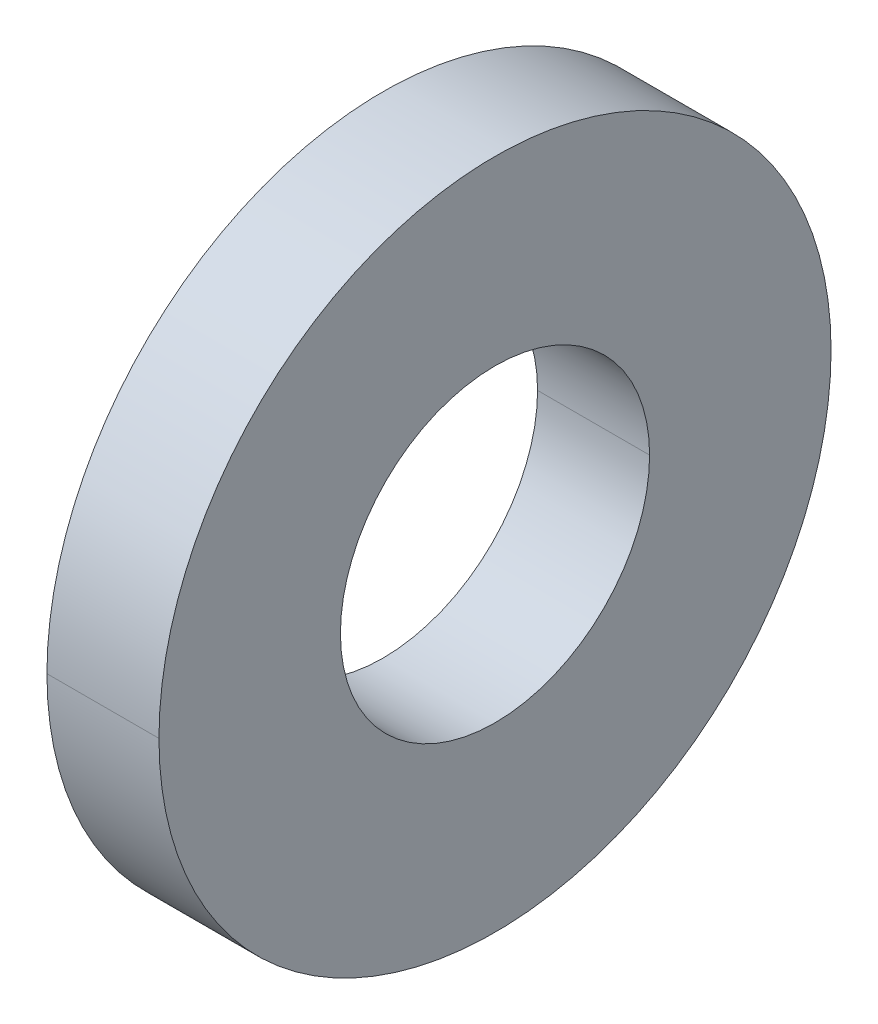
ISO-10303-21;
HEADER;
FILE_DESCRIPTION(('STEP AP214'),'2;1');
FILE_NAME('part.step','',(''),(''),'','','');
FILE_SCHEMA(('AUTOMOTIVE_DESIGN { 1 0 10303 214 1 1 1 1 }'));
ENDSEC;
DATA;
#1=APPLICATION_CONTEXT('core data for automotive mechanical design processes');
#2=APPLICATION_PROTOCOL_DEFINITION('international standard','automotive_design',2000,#1);
#3=PRODUCT_CONTEXT('',#1,'mechanical');
#4=PRODUCT('Part','Part','',(#3));
#5=PRODUCT_RELATED_PRODUCT_CATEGORY('part','',(#4));
#6=PRODUCT_DEFINITION_FORMATION('','',#4);
#7=PRODUCT_DEFINITION_CONTEXT('part definition',#1,'design');
#8=PRODUCT_DEFINITION('design','',#6,#7);
#9=PRODUCT_DEFINITION_SHAPE('','',#8);
#10=(LENGTH_UNIT() NAMED_UNIT(*) SI_UNIT(.MILLI.,.METRE.));
#11=(NAMED_UNIT(*) PLANE_ANGLE_UNIT() SI_UNIT($,.RADIAN.));
#12=(NAMED_UNIT(*) SI_UNIT($,.STERADIAN.) SOLID_ANGLE_UNIT());
#13=UNCERTAINTY_MEASURE_WITH_UNIT(LENGTH_MEASURE(1.E-05),#10,'distance_accuracy_value','');
#14=(GEOMETRIC_REPRESENTATION_CONTEXT(3) GLOBAL_UNCERTAINTY_ASSIGNED_CONTEXT((#13)) GLOBAL_UNIT_ASSIGNED_CONTEXT((#10,
#11,#12)) REPRESENTATION_CONTEXT('',''));
#15=CARTESIAN_POINT('',(0.,0.,0.));
#16=DIRECTION('',(0.,0.,1.));
#17=DIRECTION('',(1.,0.,0.));
#18=AXIS2_PLACEMENT_3D('',#15,#16,#17);
#19=CARTESIAN_POINT('',(-1.5875,9.525,0.));
#20=DIRECTION('',(-1.,0.,0.));
#21=DIRECTION('',(0.,0.,1.));
#22=AXIS2_PLACEMENT_3D('',#19,#20,#21);
#23=PLANE('',#22);
#24=CARTESIAN_POINT('',(-1.5875,0.,0.));
#25=DIRECTION('',(1.,0.,0.));
#26=DIRECTION('',(0.,0.,-1.));
#27=AXIS2_PLACEMENT_3D('',#24,#25,#26);
#28=CIRCLE('',#27,4.3815);
#29=CARTESIAN_POINT('',(-1.5875,0.,-4.3815));
#30=VERTEX_POINT('',#29);
#31=CARTESIAN_POINT('',(-1.5875,0.,4.3815));
#32=VERTEX_POINT('',#31);
#33=EDGE_CURVE('E11',#30,#32,#28,.T.);
#34=ORIENTED_EDGE('',*,*,#33,.T.);
#35=CARTESIAN_POINT('',(-1.5875,0.,0.));
#36=DIRECTION('',(1.,0.,0.));
#37=DIRECTION('',(0.,0.,-1.));
#38=AXIS2_PLACEMENT_3D('',#35,#36,#37);
#39=CIRCLE('',#38,4.3815);
#40=EDGE_CURVE('E25',#32,#30,#39,.T.);
#41=ORIENTED_EDGE('',*,*,#40,.T.);
#42=EDGE_LOOP('',(#34,#41));
#43=FACE_BOUND('',#42,.T.);
#44=CARTESIAN_POINT('',(-1.5875,0.,0.));
#45=DIRECTION('',(1.,0.,0.));
#46=DIRECTION('',(0.,0.,-1.));
#47=AXIS2_PLACEMENT_3D('',#44,#45,#46);
#48=CIRCLE('',#47,9.525);
#49=CARTESIAN_POINT('',(-1.5875,0.,9.525));
#50=VERTEX_POINT('',#49);
#51=CARTESIAN_POINT('',(-1.5875,0.,-9.525));
#52=VERTEX_POINT('',#51);
#53=EDGE_CURVE('E95',#50,#52,#48,.T.);
#54=ORIENTED_EDGE('',*,*,#53,.F.);
#55=CARTESIAN_POINT('',(-1.5875,0.,0.));
#56=DIRECTION('',(1.,0.,0.));
#57=DIRECTION('',(0.,0.,-1.));
#58=AXIS2_PLACEMENT_3D('',#55,#56,#57);
#59=CIRCLE('',#58,9.525);
#60=EDGE_CURVE('E90',#52,#50,#59,.T.);
#61=ORIENTED_EDGE('',*,*,#60,.F.);
#62=EDGE_LOOP('',(#54,#61));
#63=FACE_BOUND('',#62,.T.);
#64=ADVANCED_FACE('F17',(#43,#63),#23,.T.);
#65=CARTESIAN_POINT('',(1.5875,0.,0.));
#66=DIRECTION('',(1.,0.,0.));
#67=DIRECTION('',(0.,-1.,0.));
#68=AXIS2_PLACEMENT_3D('',#65,#66,#67);
#69=CYLINDRICAL_SURFACE('',#68,9.525);
#70=DIRECTION('',(1.,0.,0.));
#71=VECTOR('',#70,1.);
#72=CARTESIAN_POINT('',(-1.5875,0.,9.525));
#73=LINE('',#72,#71);
#74=CARTESIAN_POINT('',(1.5875,0.,9.525));
#75=VERTEX_POINT('',#74);
#76=EDGE_CURVE('E86',#50,#75,#73,.T.);
#77=ORIENTED_EDGE('',*,*,#76,.T.);
#78=CARTESIAN_POINT('',(1.5875,0.,0.));
#79=DIRECTION('',(1.,0.,0.));
#80=DIRECTION('',(0.,0.,-1.));
#81=AXIS2_PLACEMENT_3D('',#78,#79,#80);
#82=CIRCLE('',#81,9.525);
#83=CARTESIAN_POINT('',(1.5875,0.,-9.525));
#84=VERTEX_POINT('',#83);
#85=EDGE_CURVE('E81',#84,#75,#82,.T.);
#86=ORIENTED_EDGE('',*,*,#85,.F.);
#87=DIRECTION('',(1.,0.,0.));
#88=VECTOR('',#87,1.);
#89=CARTESIAN_POINT('',(-1.5875,0.,-9.525));
#90=LINE('',#89,#88);
#91=EDGE_CURVE('E70',#52,#84,#90,.T.);
#92=ORIENTED_EDGE('',*,*,#91,.F.);
#93=ORIENTED_EDGE('',*,*,#60,.T.);
#94=EDGE_LOOP('',(#77,#86,#92,#93));
#95=FACE_BOUND('',#94,.T.);
#96=ADVANCED_FACE('F111',(#95),#69,.T.);
#97=CARTESIAN_POINT('',(1.5875,0.,0.));
#98=DIRECTION('',(1.,0.,0.));
#99=DIRECTION('',(0.,1.,0.));
#100=AXIS2_PLACEMENT_3D('',#97,#98,#99);
#101=CYLINDRICAL_SURFACE('',#100,9.525);
#102=ORIENTED_EDGE('',*,*,#76,.F.);
#103=ORIENTED_EDGE('',*,*,#53,.T.);
#104=ORIENTED_EDGE('',*,*,#91,.T.);
#105=CARTESIAN_POINT('',(1.5875,0.,0.));
#106=DIRECTION('',(1.,0.,0.));
#107=DIRECTION('',(0.,0.,-1.));
#108=AXIS2_PLACEMENT_3D('',#105,#106,#107);
#109=CIRCLE('',#108,9.525);
#110=EDGE_CURVE('E67',#75,#84,#109,.T.);
#111=ORIENTED_EDGE('',*,*,#110,.F.);
#112=EDGE_LOOP('',(#102,#103,#104,#111));
#113=FACE_BOUND('',#112,.T.);
#114=ADVANCED_FACE('F106',(#113),#101,.T.);
#115=CARTESIAN_POINT('',(1.5875,4.3815,0.));
#116=DIRECTION('',(1.,0.,0.));
#117=DIRECTION('',(0.,0.,-1.));
#118=AXIS2_PLACEMENT_3D('',#115,#116,#117);
#119=PLANE('',#118);
#120=ORIENTED_EDGE('',*,*,#85,.T.);
#121=ORIENTED_EDGE('',*,*,#110,.T.);
#122=EDGE_LOOP('',(#120,#121));
#123=FACE_BOUND('',#122,.T.);
#124=CARTESIAN_POINT('',(1.5875,0.,0.));
#125=DIRECTION('',(1.,0.,0.));
#126=DIRECTION('',(0.,0.,-1.));
#127=AXIS2_PLACEMENT_3D('',#124,#125,#126);
#128=CIRCLE('',#127,4.3815);
#129=CARTESIAN_POINT('',(1.5875,0.,4.3815));
#130=VERTEX_POINT('',#129);
#131=CARTESIAN_POINT('',(1.5875,0.,-4.3815));
#132=VERTEX_POINT('',#131);
#133=EDGE_CURVE('E55',#130,#132,#128,.T.);
#134=ORIENTED_EDGE('',*,*,#133,.F.);
#135=CARTESIAN_POINT('',(1.5875,0.,0.));
#136=DIRECTION('',(1.,0.,0.));
#137=DIRECTION('',(0.,0.,-1.));
#138=AXIS2_PLACEMENT_3D('',#135,#136,#137);
#139=CIRCLE('',#138,4.3815);
#140=EDGE_CURVE('E51',#132,#130,#139,.T.);
#141=ORIENTED_EDGE('',*,*,#140,.F.);
#142=EDGE_LOOP('',(#134,#141));
#143=FACE_BOUND('',#142,.T.);
#144=ADVANCED_FACE('F53',(#123,#143),#119,.T.);
#145=CARTESIAN_POINT('',(1.5875,0.,0.));
#146=DIRECTION('',(1.,0.,0.));
#147=DIRECTION('',(0.,-1.,0.));
#148=AXIS2_PLACEMENT_3D('',#145,#146,#147);
#149=CYLINDRICAL_SURFACE('',#148,4.3815);
#150=DIRECTION('',(1.,0.,0.));
#151=VECTOR('',#150,1.);
#152=CARTESIAN_POINT('',(-1.5875,0.,4.3815));
#153=LINE('',#152,#151);
#154=EDGE_CURVE('E59',#32,#130,#153,.T.);
#155=ORIENTED_EDGE('',*,*,#154,.F.);
#156=ORIENTED_EDGE('',*,*,#33,.F.);
#157=DIRECTION('',(1.,0.,0.));
#158=VECTOR('',#157,1.);
#159=CARTESIAN_POINT('',(-1.5875,0.,-4.3815));
#160=LINE('',#159,#158);
#161=EDGE_CURVE('E62',#30,#132,#160,.T.);
#162=ORIENTED_EDGE('',*,*,#161,.T.);
#163=ORIENTED_EDGE('',*,*,#140,.T.);
#164=EDGE_LOOP('',(#155,#156,#162,#163));
#165=FACE_BOUND('',#164,.T.);
#166=ADVANCED_FACE('F63',(#165),#149,.F.);
#167=CARTESIAN_POINT('',(1.5875,0.,0.));
#168=DIRECTION('',(1.,0.,0.));
#169=DIRECTION('',(0.,1.,0.));
#170=AXIS2_PLACEMENT_3D('',#167,#168,#169);
#171=CYLINDRICAL_SURFACE('',#170,4.3815);
#172=ORIENTED_EDGE('',*,*,#154,.T.);
#173=ORIENTED_EDGE('',*,*,#133,.T.);
#174=ORIENTED_EDGE('',*,*,#161,.F.);
#175=ORIENTED_EDGE('',*,*,#40,.F.);
#176=EDGE_LOOP('',(#172,#173,#174,#175));
#177=FACE_BOUND('',#176,.T.);
#178=ADVANCED_FACE('F66',(#177),#171,.F.);
#179=CLOSED_SHELL('',(#64,#96,#114,#144,#166,#178));
#180=MANIFOLD_SOLID_BREP('B1',#179);
#181=ADVANCED_BREP_SHAPE_REPRESENTATION('',(#18,#180),#14);
#182=SHAPE_DEFINITION_REPRESENTATION(#9,#181);
ENDSEC;
END-ISO-10303-21;
